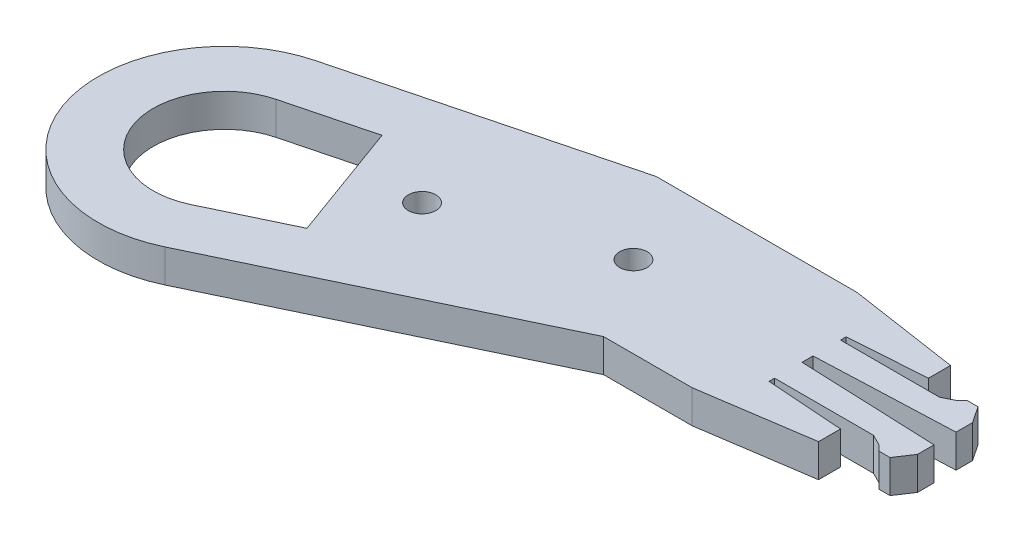
ISO-10303-21;
HEADER;
FILE_DESCRIPTION(('STEP AP214'),'2;1');
FILE_NAME('part.step','',(''),(''),'','','');
FILE_SCHEMA(('AUTOMOTIVE_DESIGN { 1 0 10303 214 1 1 1 1 }'));
ENDSEC;
DATA;
#1=APPLICATION_CONTEXT('core data for automotive mechanical design processes');
#2=APPLICATION_PROTOCOL_DEFINITION('international standard','automotive_design',2000,#1);
#3=PRODUCT_CONTEXT('',#1,'mechanical');
#4=PRODUCT('Part','Part','',(#3));
#5=PRODUCT_RELATED_PRODUCT_CATEGORY('part','',(#4));
#6=PRODUCT_DEFINITION_FORMATION('','',#4);
#7=PRODUCT_DEFINITION_CONTEXT('part definition',#1,'design');
#8=PRODUCT_DEFINITION('design','',#6,#7);
#9=PRODUCT_DEFINITION_SHAPE('','',#8);
#10=(LENGTH_UNIT() NAMED_UNIT(*) SI_UNIT(.MILLI.,.METRE.));
#11=(NAMED_UNIT(*) PLANE_ANGLE_UNIT() SI_UNIT($,.RADIAN.));
#12=(NAMED_UNIT(*) SI_UNIT($,.STERADIAN.) SOLID_ANGLE_UNIT());
#13=UNCERTAINTY_MEASURE_WITH_UNIT(LENGTH_MEASURE(1.E-05),#10,'distance_accuracy_value','');
#14=(GEOMETRIC_REPRESENTATION_CONTEXT(3) GLOBAL_UNCERTAINTY_ASSIGNED_CONTEXT((#13)) GLOBAL_UNIT_ASSIGNED_CONTEXT((#10,
#11,#12)) REPRESENTATION_CONTEXT('',''));
#15=CARTESIAN_POINT('',(0.,0.,0.));
#16=DIRECTION('',(0.,0.,1.));
#17=DIRECTION('',(1.,0.,0.));
#18=AXIS2_PLACEMENT_3D('',#15,#16,#17);
#19=CARTESIAN_POINT('',(-2.87937004662604,-3.,-11.1336978643482));
#20=DIRECTION('',(0.250380004054438,0.,0.968147640378109));
#21=DIRECTION('',(0.968147640378109,0.,-0.250380004054438));
#22=AXIS2_PLACEMENT_3D('',#19,#20,#21);
#23=PLANE('',#22);
#24=DIRECTION('',(0.968147640378109,0.,-0.250380004054438));
#25=VECTOR('',#24,1.);
#26=CARTESIAN_POINT('',(-2.87937004662604,0.,-11.1336978643482));
#27=LINE('',#26,#25);
#28=CARTESIAN_POINT('',(-2.87937004662604,0.,-11.1336978643482));
#29=VERTEX_POINT('',#28);
#30=CARTESIAN_POINT('',(21.7372937873807,0.,-17.5));
#31=VERTEX_POINT('',#30);
#32=EDGE_CURVE('E296',#29,#31,#27,.T.);
#33=ORIENTED_EDGE('',*,*,#32,.T.);
#34=DIRECTION('',(0.,1.,0.));
#35=VECTOR('',#34,1.);
#36=CARTESIAN_POINT('',(21.7372937873807,-3.,-17.5));
#37=LINE('',#36,#35);
#38=CARTESIAN_POINT('',(21.7372937873807,-3.,-17.5));
#39=VERTEX_POINT('',#38);
#40=EDGE_CURVE('E11',#39,#31,#37,.T.);
#41=ORIENTED_EDGE('',*,*,#40,.F.);
#42=DIRECTION('',(0.968147640378109,0.,-0.250380004054438));
#43=VECTOR('',#42,1.);
#44=CARTESIAN_POINT('',(-2.87937004662604,-3.,-11.1336978643482));
#45=LINE('',#44,#43);
#46=CARTESIAN_POINT('',(-2.87937004662604,-3.,-11.1336978643482));
#47=VERTEX_POINT('',#46);
#48=EDGE_CURVE('E53',#47,#39,#45,.T.);
#49=ORIENTED_EDGE('',*,*,#48,.F.);
#50=DIRECTION('',(0.,1.,0.));
#51=VECTOR('',#50,1.);
#52=CARTESIAN_POINT('',(-2.87937004662604,-3.,-11.1336978643482));
#53=LINE('',#52,#51);
#54=EDGE_CURVE('E431',#47,#29,#53,.T.);
#55=ORIENTED_EDGE('',*,*,#54,.T.);
#56=EDGE_LOOP('',(#33,#41,#49,#55));
#57=FACE_BOUND('',#56,.T.);
#58=ADVANCED_FACE('F34',(#57),#23,.F.);
#59=CARTESIAN_POINT('',(0.,-3.,-17.5));
#60=DIRECTION('',(0.,0.,-1.));
#61=DIRECTION('',(-1.,0.,0.));
#62=AXIS2_PLACEMENT_3D('',#59,#60,#61);
#63=PLANE('',#62);
#64=DIRECTION('',(-1.,0.,0.));
#65=VECTOR('',#64,1.);
#66=CARTESIAN_POINT('',(0.,0.,-17.5));
#67=LINE('',#66,#65);
#68=CARTESIAN_POINT('',(40.,0.,-17.5));
#69=VERTEX_POINT('',#68);
#70=EDGE_CURVE('E361',#69,#31,#67,.T.);
#71=ORIENTED_EDGE('',*,*,#70,.F.);
#72=DIRECTION('',(0.,1.,0.));
#73=VECTOR('',#72,1.);
#74=CARTESIAN_POINT('',(40.,-3.,-17.5));
#75=LINE('',#74,#73);
#76=CARTESIAN_POINT('',(40.,-3.,-17.5));
#77=VERTEX_POINT('',#76);
#78=EDGE_CURVE('E44',#77,#69,#75,.T.);
#79=ORIENTED_EDGE('',*,*,#78,.F.);
#80=DIRECTION('',(-1.,0.,0.));
#81=VECTOR('',#80,1.);
#82=CARTESIAN_POINT('',(0.,-3.,-17.5));
#83=LINE('',#82,#81);
#84=EDGE_CURVE('E269',#77,#39,#83,.T.);
#85=ORIENTED_EDGE('',*,*,#84,.T.);
#86=ORIENTED_EDGE('',*,*,#40,.T.);
#87=EDGE_LOOP('',(#71,#79,#85,#86));
#88=FACE_BOUND('',#87,.T.);
#89=ADVANCED_FACE('F620',(#88),#63,.T.);
#90=CARTESIAN_POINT('',(3.44743276283618,-3.,-22.9828850855746));
#91=DIRECTION('',(0.148340452930244,0.,-0.988936352868298));
#92=DIRECTION('',(-0.988936352868298,0.,-0.148340452930244));
#93=AXIS2_PLACEMENT_3D('',#90,#91,#92);
#94=PLANE('',#93);
#95=DIRECTION('',(-0.988936352868298,0.,-0.148340452930244));
#96=VECTOR('',#95,1.);
#97=CARTESIAN_POINT('',(3.44743276283618,0.,-22.9828850855746));
#98=LINE('',#97,#96);
#99=CARTESIAN_POINT('',(50.,0.,-16.));
#100=VERTEX_POINT('',#99);
#101=EDGE_CURVE('E256',#100,#69,#98,.T.);
#102=ORIENTED_EDGE('',*,*,#101,.F.);
#103=DIRECTION('',(0.,1.,0.));
#104=VECTOR('',#103,1.);
#105=CARTESIAN_POINT('',(50.,-3.,-16.));
#106=LINE('',#105,#104);
#107=CARTESIAN_POINT('',(50.,-3.,-16.));
#108=VERTEX_POINT('',#107);
#109=EDGE_CURVE('E252',#108,#100,#106,.T.);
#110=ORIENTED_EDGE('',*,*,#109,.F.);
#111=DIRECTION('',(-0.988936352868298,0.,-0.148340452930244));
#112=VECTOR('',#111,1.);
#113=CARTESIAN_POINT('',(3.44743276283618,-3.,-22.9828850855746));
#114=LINE('',#113,#112);
#115=EDGE_CURVE('E255',#108,#77,#114,.T.);
#116=ORIENTED_EDGE('',*,*,#115,.T.);
#117=ORIENTED_EDGE('',*,*,#78,.T.);
#118=EDGE_LOOP('',(#102,#110,#116,#117));
#119=FACE_BOUND('',#118,.T.);
#120=ADVANCED_FACE('F254',(#119),#94,.T.);
#121=CARTESIAN_POINT('',(50.,-3.,0.));
#122=DIRECTION('',(1.,0.,0.));
#123=DIRECTION('',(0.,0.,-1.));
#124=AXIS2_PLACEMENT_3D('',#121,#122,#123);
#125=PLANE('',#124);
#126=DIRECTION('',(0.,0.,-1.));
#127=VECTOR('',#126,1.);
#128=CARTESIAN_POINT('',(50.,0.,0.));
#129=LINE('',#128,#127);
#130=CARTESIAN_POINT('',(50.,0.,-14.));
#131=VERTEX_POINT('',#130);
#132=EDGE_CURVE('E358',#131,#100,#129,.T.);
#133=ORIENTED_EDGE('',*,*,#132,.F.);
#134=DIRECTION('',(0.,1.,0.));
#135=VECTOR('',#134,1.);
#136=CARTESIAN_POINT('',(50.,-3.,-14.));
#137=LINE('',#136,#135);
#138=CARTESIAN_POINT('',(50.,-3.,-14.));
#139=VERTEX_POINT('',#138);
#140=EDGE_CURVE('E261',#139,#131,#137,.T.);
#141=ORIENTED_EDGE('',*,*,#140,.F.);
#142=DIRECTION('',(0.,0.,-1.));
#143=VECTOR('',#142,1.);
#144=CARTESIAN_POINT('',(50.,-3.,0.));
#145=LINE('',#144,#143);
#146=EDGE_CURVE('E267',#139,#108,#145,.T.);
#147=ORIENTED_EDGE('',*,*,#146,.T.);
#148=ORIENTED_EDGE('',*,*,#109,.T.);
#149=EDGE_LOOP('',(#133,#141,#147,#148));
#150=FACE_BOUND('',#149,.T.);
#151=ADVANCED_FACE('F271',(#150),#125,.T.);
#152=CARTESIAN_POINT('',(-0.741116751269036,-3.,-10.3756345177665));
#153=DIRECTION('',(0.0712470499879097,0.,0.997458699830735));
#154=DIRECTION('',(0.997458699830735,0.,-0.0712470499879097));
#155=AXIS2_PLACEMENT_3D('',#152,#153,#154);
#156=PLANE('',#155);
#157=DIRECTION('',(0.997458699830735,0.,-0.0712470499879097));
#158=VECTOR('',#157,1.);
#159=CARTESIAN_POINT('',(-0.741116751269036,0.,-10.3756345177665));
#160=LINE('',#159,#158);
#161=CARTESIAN_POINT('',(43.,0.,-13.5));
#162=VERTEX_POINT('',#161);
#163=EDGE_CURVE('E355',#162,#131,#160,.T.);
#164=ORIENTED_EDGE('',*,*,#163,.F.);
#165=DIRECTION('',(0.,1.,0.));
#166=VECTOR('',#165,1.);
#167=CARTESIAN_POINT('',(43.,-3.,-13.5));
#168=LINE('',#167,#166);
#169=CARTESIAN_POINT('',(43.,-3.,-13.5));
#170=VERTEX_POINT('',#169);
#171=EDGE_CURVE('E373',#170,#162,#168,.T.);
#172=ORIENTED_EDGE('',*,*,#171,.F.);
#173=DIRECTION('',(0.997458699830735,0.,-0.0712470499879097));
#174=VECTOR('',#173,1.);
#175=CARTESIAN_POINT('',(-0.741116751269036,-3.,-10.3756345177665));
#176=LINE('',#175,#174);
#177=EDGE_CURVE('E272',#170,#139,#176,.T.);
#178=ORIENTED_EDGE('',*,*,#177,.T.);
#179=ORIENTED_EDGE('',*,*,#140,.T.);
#180=EDGE_LOOP('',(#164,#172,#178,#179));
#181=FACE_BOUND('',#180,.T.);
#182=ADVANCED_FACE('F623',(#181),#156,.T.);
#183=CARTESIAN_POINT('',(42.9999999999998,-3.,5.96744875736021E-13));
#184=DIRECTION('',(1.,0.,0.));
#185=DIRECTION('',(0.,0.,-1.));
#186=AXIS2_PLACEMENT_3D('',#183,#184,#185);
#187=PLANE('',#186);
#188=DIRECTION('',(0.,0.,-1.));
#189=VECTOR('',#188,1.);
#190=CARTESIAN_POINT('',(42.9999999999998,0.,5.96744875736021E-13));
#191=LINE('',#190,#189);
#192=CARTESIAN_POINT('',(43.,0.,-13.));
#193=VERTEX_POINT('',#192);
#194=EDGE_CURVE('E352',#193,#162,#191,.T.);
#195=ORIENTED_EDGE('',*,*,#194,.F.);
#196=DIRECTION('',(0.,1.,0.));
#197=VECTOR('',#196,1.);
#198=CARTESIAN_POINT('',(43.,-3.,-13.));
#199=LINE('',#198,#197);
#200=CARTESIAN_POINT('',(43.,-3.,-13.));
#201=VERTEX_POINT('',#200);
#202=EDGE_CURVE('E375',#201,#193,#199,.T.);
#203=ORIENTED_EDGE('',*,*,#202,.F.);
#204=DIRECTION('',(0.,0.,-1.));
#205=VECTOR('',#204,1.);
#206=CARTESIAN_POINT('',(42.9999999999998,-3.,5.96744875736021E-13));
#207=LINE('',#206,#205);
#208=EDGE_CURVE('E274',#201,#170,#207,.T.);
#209=ORIENTED_EDGE('',*,*,#208,.T.);
#210=ORIENTED_EDGE('',*,*,#171,.T.);
#211=EDGE_LOOP('',(#195,#203,#209,#210));
#212=FACE_BOUND('',#211,.T.);
#213=ADVANCED_FACE('F517',(#212),#187,.T.);
#214=CARTESIAN_POINT('',(0.,-3.,-13.));
#215=DIRECTION('',(0.,0.,-1.));
#216=DIRECTION('',(-1.,0.,0.));
#217=AXIS2_PLACEMENT_3D('',#214,#215,#216);
#218=PLANE('',#217);
#219=DIRECTION('',(-1.,0.,0.));
#220=VECTOR('',#219,1.);
#221=CARTESIAN_POINT('',(0.,0.,-13.));
#222=LINE('',#221,#220);
#223=CARTESIAN_POINT('',(52.,0.,-13.));
#224=VERTEX_POINT('',#223);
#225=EDGE_CURVE('E349',#224,#193,#222,.T.);
#226=ORIENTED_EDGE('',*,*,#225,.F.);
#227=DIRECTION('',(0.,1.,0.));
#228=VECTOR('',#227,1.);
#229=CARTESIAN_POINT('',(52.,-3.,-13.));
#230=LINE('',#229,#228);
#231=CARTESIAN_POINT('',(52.,-3.,-13.));
#232=VERTEX_POINT('',#231);
#233=EDGE_CURVE('E377',#232,#224,#230,.T.);
#234=ORIENTED_EDGE('',*,*,#233,.F.);
#235=DIRECTION('',(-1.,0.,0.));
#236=VECTOR('',#235,1.);
#237=CARTESIAN_POINT('',(0.,-3.,-13.));
#238=LINE('',#237,#236);
#239=EDGE_CURVE('E511',#232,#201,#238,.T.);
#240=ORIENTED_EDGE('',*,*,#239,.T.);
#241=ORIENTED_EDGE('',*,*,#202,.T.);
#242=EDGE_LOOP('',(#226,#234,#240,#241));
#243=FACE_BOUND('',#242,.T.);
#244=ADVANCED_FACE('F523',(#243),#218,.T.);
#245=CARTESIAN_POINT('',(5.19999999999995,-3.,10.3999999999999));
#246=DIRECTION('',(-0.447213595499957,0.,-0.894427190999917));
#247=DIRECTION('',(-0.894427190999917,0.,0.447213595499957));
#248=AXIS2_PLACEMENT_3D('',#245,#246,#247);
#249=PLANE('',#248);
#250=DIRECTION('',(-0.894427190999917,0.,0.447213595499957));
#251=VECTOR('',#250,1.);
#252=CARTESIAN_POINT('',(5.19999999999995,0.,10.3999999999999));
#253=LINE('',#252,#251);
#254=CARTESIAN_POINT('',(53.,0.,-13.5));
#255=VERTEX_POINT('',#254);
#256=EDGE_CURVE('E346',#255,#224,#253,.T.);
#257=ORIENTED_EDGE('',*,*,#256,.F.);
#258=DIRECTION('',(0.,1.,0.));
#259=VECTOR('',#258,1.);
#260=CARTESIAN_POINT('',(53.,-3.,-13.5));
#261=LINE('',#260,#259);
#262=CARTESIAN_POINT('',(53.,-3.,-13.5));
#263=VERTEX_POINT('',#262);
#264=EDGE_CURVE('E379',#263,#255,#261,.T.);
#265=ORIENTED_EDGE('',*,*,#264,.F.);
#266=DIRECTION('',(-0.894427190999917,0.,0.447213595499957));
#267=VECTOR('',#266,1.);
#268=CARTESIAN_POINT('',(5.19999999999995,-3.,10.3999999999999));
#269=LINE('',#268,#267);
#270=EDGE_CURVE('E508',#263,#232,#269,.T.);
#271=ORIENTED_EDGE('',*,*,#270,.T.);
#272=ORIENTED_EDGE('',*,*,#233,.T.);
#273=EDGE_LOOP('',(#257,#265,#271,#272));
#274=FACE_BOUND('',#273,.T.);
#275=ADVANCED_FACE('F526',(#274),#249,.T.);
#276=CARTESIAN_POINT('',(19.75,-3.,19.75));
#277=DIRECTION('',(-0.707106781186547,0.,-0.707106781186547));
#278=DIRECTION('',(-0.707106781186548,0.,0.707106781186548));
#279=AXIS2_PLACEMENT_3D('',#276,#277,#278);
#280=PLANE('',#279);
#281=DIRECTION('',(-0.707106781186548,0.,0.707106781186548));
#282=VECTOR('',#281,1.);
#283=CARTESIAN_POINT('',(19.75,0.,19.75));
#284=LINE('',#283,#282);
#285=CARTESIAN_POINT('',(53.5,0.,-14.));
#286=VERTEX_POINT('',#285);
#287=EDGE_CURVE('E343',#286,#255,#284,.T.);
#288=ORIENTED_EDGE('',*,*,#287,.F.);
#289=DIRECTION('',(0.,1.,0.));
#290=VECTOR('',#289,1.);
#291=CARTESIAN_POINT('',(53.5,-3.,-14.));
#292=LINE('',#291,#290);
#293=CARTESIAN_POINT('',(53.5,-3.,-14.));
#294=VERTEX_POINT('',#293);
#295=EDGE_CURVE('E381',#294,#286,#292,.T.);
#296=ORIENTED_EDGE('',*,*,#295,.F.);
#297=DIRECTION('',(-0.707106781186548,0.,0.707106781186548));
#298=VECTOR('',#297,1.);
#299=CARTESIAN_POINT('',(19.75,-3.,19.75));
#300=LINE('',#299,#298);
#301=EDGE_CURVE('E505',#294,#263,#300,.T.);
#302=ORIENTED_EDGE('',*,*,#301,.T.);
#303=ORIENTED_EDGE('',*,*,#264,.T.);
#304=EDGE_LOOP('',(#288,#296,#302,#303));
#305=FACE_BOUND('',#304,.T.);
#306=ADVANCED_FACE('F531',(#305),#280,.T.);
#307=CARTESIAN_POINT('',(0.,-3.,-13.9999999999999));
#308=DIRECTION('',(0.,0.,-1.));
#309=DIRECTION('',(-1.,0.,0.));
#310=AXIS2_PLACEMENT_3D('',#307,#308,#309);
#311=PLANE('',#310);
#312=DIRECTION('',(-1.,0.,0.));
#313=VECTOR('',#312,1.);
#314=CARTESIAN_POINT('',(0.,0.,-13.9999999999999));
#315=LINE('',#314,#313);
#316=CARTESIAN_POINT('',(54.5,0.,-14.));
#317=VERTEX_POINT('',#316);
#318=EDGE_CURVE('E340',#317,#286,#315,.T.);
#319=ORIENTED_EDGE('',*,*,#318,.F.);
#320=DIRECTION('',(0.,1.,0.));
#321=VECTOR('',#320,1.);
#322=CARTESIAN_POINT('',(54.5,-3.,-14.));
#323=LINE('',#322,#321);
#324=CARTESIAN_POINT('',(54.5,-3.,-14.));
#325=VERTEX_POINT('',#324);
#326=EDGE_CURVE('E383',#325,#317,#323,.T.);
#327=ORIENTED_EDGE('',*,*,#326,.F.);
#328=DIRECTION('',(-1.,0.,0.));
#329=VECTOR('',#328,1.);
#330=CARTESIAN_POINT('',(0.,-3.,-13.9999999999999));
#331=LINE('',#330,#329);
#332=EDGE_CURVE('E502',#325,#294,#331,.T.);
#333=ORIENTED_EDGE('',*,*,#332,.T.);
#334=ORIENTED_EDGE('',*,*,#295,.T.);
#335=EDGE_LOOP('',(#319,#327,#333,#334));
#336=FACE_BOUND('',#335,.T.);
#337=ADVANCED_FACE('F534',(#336),#311,.T.);
#338=CARTESIAN_POINT('',(44.1923076923077,-3.,-29.4615384615385));
#339=DIRECTION('',(0.832050294337843,0.,-0.554700196225229));
#340=DIRECTION('',(-0.554700196225229,0.,-0.832050294337844));
#341=AXIS2_PLACEMENT_3D('',#338,#339,#340);
#342=PLANE('',#341);
#343=DIRECTION('',(-0.554700196225229,0.,-0.832050294337844));
#344=VECTOR('',#343,1.);
#345=CARTESIAN_POINT('',(44.1923076923077,0.,-29.4615384615385));
#346=LINE('',#345,#344);
#347=CARTESIAN_POINT('',(55.5,0.,-12.5));
#348=VERTEX_POINT('',#347);
#349=EDGE_CURVE('E337',#348,#317,#346,.T.);
#350=ORIENTED_EDGE('',*,*,#349,.F.);
#351=DIRECTION('',(0.,1.,0.));
#352=VECTOR('',#351,1.);
#353=CARTESIAN_POINT('',(55.5,-3.,-12.5));
#354=LINE('',#353,#352);
#355=CARTESIAN_POINT('',(55.5,-3.,-12.5));
#356=VERTEX_POINT('',#355);
#357=EDGE_CURVE('E385',#356,#348,#354,.T.);
#358=ORIENTED_EDGE('',*,*,#357,.F.);
#359=DIRECTION('',(-0.554700196225229,0.,-0.832050294337844));
#360=VECTOR('',#359,1.);
#361=CARTESIAN_POINT('',(44.1923076923077,-3.,-29.4615384615385));
#362=LINE('',#361,#360);
#363=EDGE_CURVE('E499',#356,#325,#362,.T.);
#364=ORIENTED_EDGE('',*,*,#363,.T.);
#365=ORIENTED_EDGE('',*,*,#326,.T.);
#366=EDGE_LOOP('',(#350,#358,#364,#365));
#367=FACE_BOUND('',#366,.T.);
#368=ADVANCED_FACE('F539',(#367),#342,.T.);
#369=CARTESIAN_POINT('',(55.5,-3.,0.));
#370=DIRECTION('',(1.,0.,0.));
#371=DIRECTION('',(0.,0.,-1.));
#372=AXIS2_PLACEMENT_3D('',#369,#370,#371);
#373=PLANE('',#372);
#374=DIRECTION('',(0.,0.,-1.));
#375=VECTOR('',#374,1.);
#376=CARTESIAN_POINT('',(55.5,0.,0.));
#377=LINE('',#376,#375);
#378=CARTESIAN_POINT('',(55.5,0.,-11.));
#379=VERTEX_POINT('',#378);
#380=EDGE_CURVE('E334',#379,#348,#377,.T.);
#381=ORIENTED_EDGE('',*,*,#380,.F.);
#382=DIRECTION('',(0.,1.,0.));
#383=VECTOR('',#382,1.);
#384=CARTESIAN_POINT('',(55.5,-3.,-11.));
#385=LINE('',#384,#383);
#386=CARTESIAN_POINT('',(55.5,-3.,-11.));
#387=VERTEX_POINT('',#386);
#388=EDGE_CURVE('E387',#387,#379,#385,.T.);
#389=ORIENTED_EDGE('',*,*,#388,.F.);
#390=DIRECTION('',(0.,0.,-1.));
#391=VECTOR('',#390,1.);
#392=CARTESIAN_POINT('',(55.5,-3.,0.));
#393=LINE('',#392,#391);
#394=EDGE_CURVE('E496',#387,#356,#393,.T.);
#395=ORIENTED_EDGE('',*,*,#394,.T.);
#396=ORIENTED_EDGE('',*,*,#357,.T.);
#397=EDGE_LOOP('',(#381,#389,#395,#396));
#398=FACE_BOUND('',#397,.T.);
#399=ADVANCED_FACE('F542',(#398),#373,.T.);
#400=CARTESIAN_POINT('',(-0.350638977635782,-3.,-8.76597444089457));
#401=DIRECTION('',(0.0399680383488715,0.,0.999200958721789));
#402=DIRECTION('',(0.99920095872179,0.,-0.0399680383488715));
#403=AXIS2_PLACEMENT_3D('',#400,#401,#402);
#404=PLANE('',#403);
#405=DIRECTION('',(0.99920095872179,0.,-0.0399680383488715));
#406=VECTOR('',#405,1.);
#407=CARTESIAN_POINT('',(-0.350638977635782,0.,-8.76597444089457));
#408=LINE('',#407,#406);
#409=CARTESIAN_POINT('',(43.,0.,-10.5));
#410=VERTEX_POINT('',#409);
#411=EDGE_CURVE('E331',#410,#379,#408,.T.);
#412=ORIENTED_EDGE('',*,*,#411,.F.);
#413=DIRECTION('',(0.,1.,0.));
#414=VECTOR('',#413,1.);
#415=CARTESIAN_POINT('',(43.,-3.,-10.5));
#416=LINE('',#415,#414);
#417=CARTESIAN_POINT('',(43.,-3.,-10.5));
#418=VERTEX_POINT('',#417);
#419=EDGE_CURVE('E389',#418,#410,#416,.T.);
#420=ORIENTED_EDGE('',*,*,#419,.F.);
#421=DIRECTION('',(0.99920095872179,0.,-0.0399680383488715));
#422=VECTOR('',#421,1.);
#423=CARTESIAN_POINT('',(-0.350638977635782,-3.,-8.76597444089457));
#424=LINE('',#423,#422);
#425=EDGE_CURVE('E493',#418,#387,#424,.T.);
#426=ORIENTED_EDGE('',*,*,#425,.T.);
#427=ORIENTED_EDGE('',*,*,#388,.T.);
#428=EDGE_LOOP('',(#412,#420,#426,#427));
#429=FACE_BOUND('',#428,.T.);
#430=ADVANCED_FACE('F546',(#429),#404,.T.);
#431=CARTESIAN_POINT('',(43.,-3.,0.));
#432=DIRECTION('',(-1.,0.,0.));
#433=DIRECTION('',(0.,0.,1.));
#434=AXIS2_PLACEMENT_3D('',#431,#432,#433);
#435=PLANE('',#434);
#436=DIRECTION('',(0.,0.,1.));
#437=VECTOR('',#436,1.);
#438=CARTESIAN_POINT('',(43.,0.,0.));
#439=LINE('',#438,#437);
#440=CARTESIAN_POINT('',(43.,0.,-9.5));
#441=VERTEX_POINT('',#440);
#442=EDGE_CURVE('E329',#410,#441,#439,.T.);
#443=ORIENTED_EDGE('',*,*,#442,.T.);
#444=DIRECTION('',(0.,1.,0.));
#445=VECTOR('',#444,1.);
#446=CARTESIAN_POINT('',(43.,-3.,-9.5));
#447=LINE('',#446,#445);
#448=CARTESIAN_POINT('',(43.,-3.,-9.5));
#449=VERTEX_POINT('',#448);
#450=EDGE_CURVE('E391',#449,#441,#447,.T.);
#451=ORIENTED_EDGE('',*,*,#450,.F.);
#452=DIRECTION('',(0.,0.,1.));
#453=VECTOR('',#452,1.);
#454=CARTESIAN_POINT('',(43.,-3.,0.));
#455=LINE('',#454,#453);
#456=EDGE_CURVE('E491',#418,#449,#455,.T.);
#457=ORIENTED_EDGE('',*,*,#456,.F.);
#458=ORIENTED_EDGE('',*,*,#419,.T.);
#459=EDGE_LOOP('',(#443,#451,#457,#458));
#460=FACE_BOUND('',#459,.T.);
#461=ADVANCED_FACE('F551',(#460),#435,.F.);
#462=CARTESIAN_POINT('',(0.448083067092651,-3.,-11.2020766773163));
#463=DIRECTION('',(-0.0399680383488715,0.,0.999200958721789));
#464=DIRECTION('',(0.99920095872179,0.,0.0399680383488715));
#465=AXIS2_PLACEMENT_3D('',#462,#463,#464);
#466=PLANE('',#465);
#467=DIRECTION('',(0.99920095872179,0.,0.0399680383488715));
#468=VECTOR('',#467,1.);
#469=CARTESIAN_POINT('',(0.448083067092651,0.,-11.2020766773163));
#470=LINE('',#469,#468);
#471=CARTESIAN_POINT('',(55.5,0.,-9.));
#472=VERTEX_POINT('',#471);
#473=EDGE_CURVE('E327',#441,#472,#470,.T.);
#474=ORIENTED_EDGE('',*,*,#473,.T.);
#475=DIRECTION('',(0.,1.,0.));
#476=VECTOR('',#475,1.);
#477=CARTESIAN_POINT('',(55.5,-3.,-9.));
#478=LINE('',#477,#476);
#479=CARTESIAN_POINT('',(55.5,-3.,-9.));
#480=VERTEX_POINT('',#479);
#481=EDGE_CURVE('E394',#480,#472,#478,.T.);
#482=ORIENTED_EDGE('',*,*,#481,.F.);
#483=DIRECTION('',(0.99920095872179,0.,0.0399680383488715));
#484=VECTOR('',#483,1.);
#485=CARTESIAN_POINT('',(0.448083067092651,-3.,-11.2020766773163));
#486=LINE('',#485,#484);
#487=EDGE_CURVE('E489',#449,#480,#486,.T.);
#488=ORIENTED_EDGE('',*,*,#487,.F.);
#489=ORIENTED_EDGE('',*,*,#450,.T.);
#490=EDGE_LOOP('',(#474,#482,#488,#489));
#491=FACE_BOUND('',#490,.T.);
#492=ADVANCED_FACE('F557',(#491),#466,.F.);
#493=CARTESIAN_POINT('',(55.5,-3.,0.));
#494=DIRECTION('',(-1.,0.,0.));
#495=DIRECTION('',(0.,0.,1.));
#496=AXIS2_PLACEMENT_3D('',#493,#494,#495);
#497=PLANE('',#496);
#498=DIRECTION('',(0.,0.,1.));
#499=VECTOR('',#498,1.);
#500=CARTESIAN_POINT('',(55.5,0.,0.));
#501=LINE('',#500,#499);
#502=CARTESIAN_POINT('',(55.5,0.,-7.5));
#503=VERTEX_POINT('',#502);
#504=EDGE_CURVE('E325',#472,#503,#501,.T.);
#505=ORIENTED_EDGE('',*,*,#504,.T.);
#506=DIRECTION('',(0.,1.,0.));
#507=VECTOR('',#506,1.);
#508=CARTESIAN_POINT('',(55.5,-3.,-7.5));
#509=LINE('',#508,#507);
#510=CARTESIAN_POINT('',(55.5,-3.,-7.5));
#511=VERTEX_POINT('',#510);
#512=EDGE_CURVE('E397',#511,#503,#509,.T.);
#513=ORIENTED_EDGE('',*,*,#512,.F.);
#514=DIRECTION('',(0.,0.,1.));
#515=VECTOR('',#514,1.);
#516=CARTESIAN_POINT('',(55.5,-3.,0.));
#517=LINE('',#516,#515);
#518=EDGE_CURVE('E487',#480,#511,#517,.T.);
#519=ORIENTED_EDGE('',*,*,#518,.F.);
#520=ORIENTED_EDGE('',*,*,#481,.T.);
#521=EDGE_LOOP('',(#505,#513,#519,#520));
#522=FACE_BOUND('',#521,.T.);
#523=ADVANCED_FACE('F561',(#522),#497,.F.);
#524=CARTESIAN_POINT('',(34.9615384615384,-3.,23.3076923076923));
#525=DIRECTION('',(-0.832050294337843,0.,-0.554700196225229));
#526=DIRECTION('',(-0.554700196225229,0.,0.832050294337844));
#527=AXIS2_PLACEMENT_3D('',#524,#525,#526);
#528=PLANE('',#527);
#529=DIRECTION('',(-0.554700196225229,0.,0.832050294337844));
#530=VECTOR('',#529,1.);
#531=CARTESIAN_POINT('',(34.9615384615384,0.,23.3076923076923));
#532=LINE('',#531,#530);
#533=CARTESIAN_POINT('',(54.5,0.,-6.));
#534=VERTEX_POINT('',#533);
#535=EDGE_CURVE('E323',#503,#534,#532,.T.);
#536=ORIENTED_EDGE('',*,*,#535,.T.);
#537=DIRECTION('',(0.,1.,0.));
#538=VECTOR('',#537,1.);
#539=CARTESIAN_POINT('',(54.5,-3.,-6.));
#540=LINE('',#539,#538);
#541=CARTESIAN_POINT('',(54.5,-3.,-6.));
#542=VERTEX_POINT('',#541);
#543=EDGE_CURVE('E400',#542,#534,#540,.T.);
#544=ORIENTED_EDGE('',*,*,#543,.F.);
#545=DIRECTION('',(-0.554700196225229,0.,0.832050294337844));
#546=VECTOR('',#545,1.);
#547=CARTESIAN_POINT('',(34.9615384615384,-3.,23.3076923076923));
#548=LINE('',#547,#546);
#549=EDGE_CURVE('E485',#511,#542,#548,.T.);
#550=ORIENTED_EDGE('',*,*,#549,.F.);
#551=ORIENTED_EDGE('',*,*,#512,.T.);
#552=EDGE_LOOP('',(#536,#544,#550,#551));
#553=FACE_BOUND('',#552,.T.);
#554=ADVANCED_FACE('F566',(#553),#528,.F.);
#555=CARTESIAN_POINT('',(0.,-3.,-6.00000000000005));
#556=DIRECTION('',(0.,0.,-1.));
#557=DIRECTION('',(-1.,0.,0.));
#558=AXIS2_PLACEMENT_3D('',#555,#556,#557);
#559=PLANE('',#558);
#560=DIRECTION('',(-1.,0.,0.));
#561=VECTOR('',#560,1.);
#562=CARTESIAN_POINT('',(0.,0.,-6.00000000000005));
#563=LINE('',#562,#561);
#564=CARTESIAN_POINT('',(53.5,0.,-6.));
#565=VERTEX_POINT('',#564);
#566=EDGE_CURVE('E321',#534,#565,#563,.T.);
#567=ORIENTED_EDGE('',*,*,#566,.T.);
#568=DIRECTION('',(0.,1.,0.));
#569=VECTOR('',#568,1.);
#570=CARTESIAN_POINT('',(53.5,-3.,-6.));
#571=LINE('',#570,#569);
#572=CARTESIAN_POINT('',(53.5,-3.,-6.));
#573=VERTEX_POINT('',#572);
#574=EDGE_CURVE('E403',#573,#565,#571,.T.);
#575=ORIENTED_EDGE('',*,*,#574,.F.);
#576=DIRECTION('',(-1.,0.,0.));
#577=VECTOR('',#576,1.);
#578=CARTESIAN_POINT('',(0.,-3.,-6.00000000000005));
#579=LINE('',#578,#577);
#580=EDGE_CURVE('E483',#542,#573,#579,.T.);
#581=ORIENTED_EDGE('',*,*,#580,.F.);
#582=ORIENTED_EDGE('',*,*,#543,.T.);
#583=EDGE_LOOP('',(#567,#575,#581,#582));
#584=FACE_BOUND('',#583,.T.);
#585=ADVANCED_FACE('F572',(#584),#559,.F.);
#586=CARTESIAN_POINT('',(29.75,-3.,-29.75));
#587=DIRECTION('',(0.707106781186547,0.,-0.707106781186547));
#588=DIRECTION('',(-0.707106781186548,0.,-0.707106781186548));
#589=AXIS2_PLACEMENT_3D('',#586,#587,#588);
#590=PLANE('',#589);
#591=DIRECTION('',(-0.707106781186548,0.,-0.707106781186548));
#592=VECTOR('',#591,1.);
#593=CARTESIAN_POINT('',(29.75,0.,-29.75));
#594=LINE('',#593,#592);
#595=CARTESIAN_POINT('',(53.,0.,-6.5));
#596=VERTEX_POINT('',#595);
#597=EDGE_CURVE('E319',#565,#596,#594,.T.);
#598=ORIENTED_EDGE('',*,*,#597,.T.);
#599=DIRECTION('',(0.,1.,0.));
#600=VECTOR('',#599,1.);
#601=CARTESIAN_POINT('',(53.,-3.,-6.5));
#602=LINE('',#601,#600);
#603=CARTESIAN_POINT('',(53.,-3.,-6.5));
#604=VERTEX_POINT('',#603);
#605=EDGE_CURVE('E406',#604,#596,#602,.T.);
#606=ORIENTED_EDGE('',*,*,#605,.F.);
#607=DIRECTION('',(-0.707106781186548,0.,-0.707106781186548));
#608=VECTOR('',#607,1.);
#609=CARTESIAN_POINT('',(29.75,-3.,-29.75));
#610=LINE('',#609,#608);
#611=EDGE_CURVE('E481',#573,#604,#610,.T.);
#612=ORIENTED_EDGE('',*,*,#611,.F.);
#613=ORIENTED_EDGE('',*,*,#574,.T.);
#614=EDGE_LOOP('',(#598,#606,#612,#613));
#615=FACE_BOUND('',#614,.T.);
#616=ADVANCED_FACE('F576',(#615),#590,.F.);
#617=CARTESIAN_POINT('',(13.2,-3.,-26.4));
#618=DIRECTION('',(0.447213595499957,0.,-0.894427190999916));
#619=DIRECTION('',(-0.894427190999916,0.,-0.447213595499957));
#620=AXIS2_PLACEMENT_3D('',#617,#618,#619);
#621=PLANE('',#620);
#622=DIRECTION('',(-0.894427190999916,0.,-0.447213595499957));
#623=VECTOR('',#622,1.);
#624=CARTESIAN_POINT('',(13.2,0.,-26.4));
#625=LINE('',#624,#623);
#626=CARTESIAN_POINT('',(52.,0.,-7.));
#627=VERTEX_POINT('',#626);
#628=EDGE_CURVE('E317',#596,#627,#625,.T.);
#629=ORIENTED_EDGE('',*,*,#628,.T.);
#630=DIRECTION('',(0.,1.,0.));
#631=VECTOR('',#630,1.);
#632=CARTESIAN_POINT('',(52.,-3.,-7.));
#633=LINE('',#632,#631);
#634=CARTESIAN_POINT('',(52.,-3.,-7.));
#635=VERTEX_POINT('',#634);
#636=EDGE_CURVE('E409',#635,#627,#633,.T.);
#637=ORIENTED_EDGE('',*,*,#636,.F.);
#638=DIRECTION('',(-0.894427190999916,0.,-0.447213595499957));
#639=VECTOR('',#638,1.);
#640=CARTESIAN_POINT('',(13.2,-3.,-26.4));
#641=LINE('',#640,#639);
#642=EDGE_CURVE('E479',#604,#635,#641,.T.);
#643=ORIENTED_EDGE('',*,*,#642,.F.);
#644=ORIENTED_EDGE('',*,*,#605,.T.);
#645=EDGE_LOOP('',(#629,#637,#643,#644));
#646=FACE_BOUND('',#645,.T.);
#647=ADVANCED_FACE('F581',(#646),#621,.F.);
#648=CARTESIAN_POINT('',(0.,-3.,-7.00000000000001));
#649=DIRECTION('',(0.,0.,-1.));
#650=DIRECTION('',(-1.,0.,0.));
#651=AXIS2_PLACEMENT_3D('',#648,#649,#650);
#652=PLANE('',#651);
#653=DIRECTION('',(-1.,0.,0.));
#654=VECTOR('',#653,1.);
#655=CARTESIAN_POINT('',(0.,0.,-7.00000000000001));
#656=LINE('',#655,#654);
#657=CARTESIAN_POINT('',(43.,0.,-7.));
#658=VERTEX_POINT('',#657);
#659=EDGE_CURVE('E315',#627,#658,#656,.T.);
#660=ORIENTED_EDGE('',*,*,#659,.T.);
#661=DIRECTION('',(0.,1.,0.));
#662=VECTOR('',#661,1.);
#663=CARTESIAN_POINT('',(43.,-3.,-7.));
#664=LINE('',#663,#662);
#665=CARTESIAN_POINT('',(43.,-3.,-7.));
#666=VERTEX_POINT('',#665);
#667=EDGE_CURVE('E412',#666,#658,#664,.T.);
#668=ORIENTED_EDGE('',*,*,#667,.F.);
#669=DIRECTION('',(-1.,0.,0.));
#670=VECTOR('',#669,1.);
#671=CARTESIAN_POINT('',(0.,-3.,-7.00000000000001));
#672=LINE('',#671,#670);
#673=EDGE_CURVE('E477',#635,#666,#672,.T.);
#674=ORIENTED_EDGE('',*,*,#673,.F.);
#675=ORIENTED_EDGE('',*,*,#636,.T.);
#676=EDGE_LOOP('',(#660,#668,#674,#675));
#677=FACE_BOUND('',#676,.T.);
#678=ADVANCED_FACE('F587',(#677),#652,.F.);
#679=CARTESIAN_POINT('',(43.0000000000001,-3.,-5.96744875736023E-13));
#680=DIRECTION('',(-1.,0.,0.));
#681=DIRECTION('',(0.,0.,1.));
#682=AXIS2_PLACEMENT_3D('',#679,#680,#681);
#683=PLANE('',#682);
#684=DIRECTION('',(0.,0.,1.));
#685=VECTOR('',#684,1.);
#686=CARTESIAN_POINT('',(43.0000000000001,0.,-5.96744875736023E-13));
#687=LINE('',#686,#685);
#688=CARTESIAN_POINT('',(43.,0.,-6.5));
#689=VERTEX_POINT('',#688);
#690=EDGE_CURVE('E313',#658,#689,#687,.T.);
#691=ORIENTED_EDGE('',*,*,#690,.T.);
#692=DIRECTION('',(0.,1.,0.));
#693=VECTOR('',#692,1.);
#694=CARTESIAN_POINT('',(43.,-3.,-6.5));
#695=LINE('',#694,#693);
#696=CARTESIAN_POINT('',(43.,-3.,-6.5));
#697=VERTEX_POINT('',#696);
#698=EDGE_CURVE('E415',#697,#689,#695,.T.);
#699=ORIENTED_EDGE('',*,*,#698,.F.);
#700=DIRECTION('',(0.,0.,1.));
#701=VECTOR('',#700,1.);
#702=CARTESIAN_POINT('',(43.0000000000001,-3.,-5.96744875736023E-13));
#703=LINE('',#702,#701);
#704=EDGE_CURVE('E475',#666,#697,#703,.T.);
#705=ORIENTED_EDGE('',*,*,#704,.F.);
#706=ORIENTED_EDGE('',*,*,#667,.T.);
#707=EDGE_LOOP('',(#691,#699,#705,#706));
#708=FACE_BOUND('',#707,.T.);
#709=ADVANCED_FACE('F591',(#708),#683,.F.);
#710=CARTESIAN_POINT('',(0.680203045685279,-3.,-9.52284263959391));
#711=DIRECTION('',(-0.0712470499879096,0.,0.997458699830735));
#712=DIRECTION('',(0.997458699830735,0.,0.0712470499879096));
#713=AXIS2_PLACEMENT_3D('',#710,#711,#712);
#714=PLANE('',#713);
#715=DIRECTION('',(0.997458699830735,0.,0.0712470499879096));
#716=VECTOR('',#715,1.);
#717=CARTESIAN_POINT('',(0.680203045685279,0.,-9.52284263959391));
#718=LINE('',#717,#716);
#719=CARTESIAN_POINT('',(50.,0.,-6.));
#720=VERTEX_POINT('',#719);
#721=EDGE_CURVE('E311',#689,#720,#718,.T.);
#722=ORIENTED_EDGE('',*,*,#721,.T.);
#723=DIRECTION('',(0.,1.,0.));
#724=VECTOR('',#723,1.);
#725=CARTESIAN_POINT('',(50.,-3.,-6.));
#726=LINE('',#725,#724);
#727=CARTESIAN_POINT('',(50.,-3.,-6.));
#728=VERTEX_POINT('',#727);
#729=EDGE_CURVE('E418',#728,#720,#726,.T.);
#730=ORIENTED_EDGE('',*,*,#729,.F.);
#731=DIRECTION('',(0.997458699830735,0.,0.0712470499879096));
#732=VECTOR('',#731,1.);
#733=CARTESIAN_POINT('',(0.680203045685279,-3.,-9.52284263959391));
#734=LINE('',#733,#732);
#735=EDGE_CURVE('E473',#697,#728,#734,.T.);
#736=ORIENTED_EDGE('',*,*,#735,.F.);
#737=ORIENTED_EDGE('',*,*,#698,.T.);
#738=EDGE_LOOP('',(#722,#730,#736,#737));
#739=FACE_BOUND('',#738,.T.);
#740=ADVANCED_FACE('F596',(#739),#714,.F.);
#741=CARTESIAN_POINT('',(50.,-3.,0.));
#742=DIRECTION('',(-1.,0.,0.));
#743=DIRECTION('',(0.,0.,1.));
#744=AXIS2_PLACEMENT_3D('',#741,#742,#743);
#745=PLANE('',#744);
#746=DIRECTION('',(0.,0.,1.));
#747=VECTOR('',#746,1.);
#748=CARTESIAN_POINT('',(50.,0.,0.));
#749=LINE('',#748,#747);
#750=CARTESIAN_POINT('',(50.,0.,-4.));
#751=VERTEX_POINT('',#750);
#752=EDGE_CURVE('E309',#720,#751,#749,.T.);
#753=ORIENTED_EDGE('',*,*,#752,.T.);
#754=DIRECTION('',(0.,1.,0.));
#755=VECTOR('',#754,1.);
#756=CARTESIAN_POINT('',(50.,-3.,-4.));
#757=LINE('',#756,#755);
#758=CARTESIAN_POINT('',(50.,-3.,-4.));
#759=VERTEX_POINT('',#758);
#760=EDGE_CURVE('E421',#759,#751,#757,.T.);
#761=ORIENTED_EDGE('',*,*,#760,.F.);
#762=DIRECTION('',(0.,0.,1.));
#763=VECTOR('',#762,1.);
#764=CARTESIAN_POINT('',(50.,-3.,0.));
#765=LINE('',#764,#763);
#766=EDGE_CURVE('E471',#728,#759,#765,.T.);
#767=ORIENTED_EDGE('',*,*,#766,.F.);
#768=ORIENTED_EDGE('',*,*,#729,.T.);
#769=EDGE_LOOP('',(#753,#761,#767,#768));
#770=FACE_BOUND('',#769,.T.);
#771=ADVANCED_FACE('F602',(#770),#745,.F.);
#772=CARTESIAN_POINT('',(0.513447432762835,-3.,3.42298288508557));
#773=DIRECTION('',(-0.148340452930245,0.,-0.988936352868298));
#774=DIRECTION('',(-0.988936352868298,0.,0.148340452930245));
#775=AXIS2_PLACEMENT_3D('',#772,#773,#774);
#776=PLANE('',#775);
#777=DIRECTION('',(-0.988936352868298,0.,0.148340452930245));
#778=VECTOR('',#777,1.);
#779=CARTESIAN_POINT('',(0.513447432762835,0.,3.42298288508557));
#780=LINE('',#779,#778);
#781=CARTESIAN_POINT('',(40.,0.,-2.5));
#782=VERTEX_POINT('',#781);
#783=EDGE_CURVE('E307',#751,#782,#780,.T.);
#784=ORIENTED_EDGE('',*,*,#783,.T.);
#785=DIRECTION('',(0.,1.,0.));
#786=VECTOR('',#785,1.);
#787=CARTESIAN_POINT('',(40.,-3.,-2.5));
#788=LINE('',#787,#786);
#789=CARTESIAN_POINT('',(40.,-3.,-2.5));
#790=VERTEX_POINT('',#789);
#791=EDGE_CURVE('E424',#790,#782,#788,.T.);
#792=ORIENTED_EDGE('',*,*,#791,.F.);
#793=DIRECTION('',(-0.988936352868298,0.,0.148340452930245));
#794=VECTOR('',#793,1.);
#795=CARTESIAN_POINT('',(0.513447432762835,-3.,3.42298288508557));
#796=LINE('',#795,#794);
#797=EDGE_CURVE('E469',#759,#790,#796,.T.);
#798=ORIENTED_EDGE('',*,*,#797,.F.);
#799=ORIENTED_EDGE('',*,*,#760,.T.);
#800=EDGE_LOOP('',(#784,#792,#798,#799));
#801=FACE_BOUND('',#800,.T.);
#802=ADVANCED_FACE('F606',(#801),#776,.F.);
#803=CARTESIAN_POINT('',(0.,-3.,-2.50000000000002));
#804=DIRECTION('',(0.,0.,-1.));
#805=DIRECTION('',(-1.,0.,0.));
#806=AXIS2_PLACEMENT_3D('',#803,#804,#805);
#807=PLANE('',#806);
#808=DIRECTION('',(-1.,0.,0.));
#809=VECTOR('',#808,1.);
#810=CARTESIAN_POINT('',(0.,0.,-2.50000000000002));
#811=LINE('',#810,#809);
#812=CARTESIAN_POINT('',(31.9537947171671,0.,-2.50000000000001));
#813=VERTEX_POINT('',#812);
#814=EDGE_CURVE('E304',#782,#813,#811,.T.);
#815=ORIENTED_EDGE('',*,*,#814,.T.);
#816=DIRECTION('',(0.,1.,0.));
#817=VECTOR('',#816,1.);
#818=CARTESIAN_POINT('',(31.9537947171671,-3.,-2.50000000000001));
#819=LINE('',#818,#817);
#820=CARTESIAN_POINT('',(31.9537947171671,-3.,-2.50000000000001));
#821=VERTEX_POINT('',#820);
#822=EDGE_CURVE('E427',#821,#813,#819,.T.);
#823=ORIENTED_EDGE('',*,*,#822,.F.);
#824=DIRECTION('',(-1.,0.,0.));
#825=VECTOR('',#824,1.);
#826=CARTESIAN_POINT('',(0.,-3.,-2.50000000000002));
#827=LINE('',#826,#825);
#828=EDGE_CURVE('E467',#790,#821,#827,.T.);
#829=ORIENTED_EDGE('',*,*,#828,.F.);
#830=ORIENTED_EDGE('',*,*,#791,.T.);
#831=EDGE_LOOP('',(#815,#823,#829,#830));
#832=FACE_BOUND('',#831,.T.);
#833=ADVANCED_FACE('F611',(#832),#807,.F.);
#834=CARTESIAN_POINT('',(4.95087761329537,-3.,10.3797307700234));
#835=DIRECTION('',(0.430511096808293,0.,0.902585284349862));
#836=DIRECTION('',(0.902585284349862,0.,-0.430511096808293));
#837=AXIS2_PLACEMENT_3D('',#834,#835,#836);
#838=PLANE('',#837);
#839=DIRECTION('',(0.902585284349862,0.,-0.430511096808293));
#840=VECTOR('',#839,1.);
#841=CARTESIAN_POINT('',(4.95087761329537,0.,10.3797307700234));
#842=LINE('',#841,#840);
#843=CARTESIAN_POINT('',(4.95087761329537,0.,10.3797307700234));
#844=VERTEX_POINT('',#843);
#845=EDGE_CURVE('E301',#844,#813,#842,.T.);
#846=ORIENTED_EDGE('',*,*,#845,.F.);
#847=DIRECTION('',(0.,1.,0.));
#848=VECTOR('',#847,1.);
#849=CARTESIAN_POINT('',(4.95087761329537,-3.,10.3797307700234));
#850=LINE('',#849,#848);
#851=CARTESIAN_POINT('',(4.95087761329537,-3.,10.3797307700234));
#852=VERTEX_POINT('',#851);
#853=EDGE_CURVE('E429',#852,#844,#850,.T.);
#854=ORIENTED_EDGE('',*,*,#853,.F.);
#855=DIRECTION('',(0.902585284349862,0.,-0.430511096808293));
#856=VECTOR('',#855,1.);
#857=CARTESIAN_POINT('',(4.95087761329537,-3.,10.3797307700234));
#858=LINE('',#857,#856);
#859=EDGE_CURVE('E464',#852,#821,#858,.T.);
#860=ORIENTED_EDGE('',*,*,#859,.T.);
#861=ORIENTED_EDGE('',*,*,#822,.T.);
#862=EDGE_LOOP('',(#846,#854,#860,#861));
#863=FACE_BOUND('',#862,.T.);
#864=ADVANCED_FACE('F847',(#863),#838,.T.);
#865=CARTESIAN_POINT('',(0.,-3.,0.));
#866=DIRECTION('',(0.,1.,0.));
#867=DIRECTION('',(0.,0.,1.));
#868=AXIS2_PLACEMENT_3D('',#865,#866,#867);
#869=CYLINDRICAL_SURFACE('',#868,6.5);
#870=CARTESIAN_POINT('',(0.,0.,0.));
#871=DIRECTION('',(0.,1.,0.));
#872=DIRECTION('',(0.,0.,1.));
#873=AXIS2_PLACEMENT_3D('',#870,#871,#872);
#874=CIRCLE('',#873,6.5);
#875=CARTESIAN_POINT('',(-1.62747002635385,0.,-6.29295966245771));
#876=VERTEX_POINT('',#875);
#877=CARTESIAN_POINT('',(2.7983221292539,0.,5.86680434827411));
#878=VERTEX_POINT('',#877);
#879=EDGE_CURVE('E285',#876,#878,#874,.T.);
#880=ORIENTED_EDGE('',*,*,#879,.T.);
#881=DIRECTION('',(0.,1.,0.));
#882=VECTOR('',#881,1.);
#883=CARTESIAN_POINT('',(2.7983221292539,-3.,5.86680434827411));
#884=LINE('',#883,#882);
#885=CARTESIAN_POINT('',(2.7983221292539,-3.,5.86680434827411));
#886=VERTEX_POINT('',#885);
#887=EDGE_CURVE('E433',#886,#878,#884,.T.);
#888=ORIENTED_EDGE('',*,*,#887,.F.);
#889=CARTESIAN_POINT('',(0.,-3.,0.));
#890=DIRECTION('',(0.,1.,0.));
#891=DIRECTION('',(0.,0.,1.));
#892=AXIS2_PLACEMENT_3D('',#889,#890,#891);
#893=CIRCLE('',#892,6.5);
#894=CARTESIAN_POINT('',(-1.62747002635385,-3.,-6.29295966245771));
#895=VERTEX_POINT('',#894);
#896=EDGE_CURVE('E369',#895,#886,#893,.T.);
#897=ORIENTED_EDGE('',*,*,#896,.F.);
#898=DIRECTION('',(0.,1.,0.));
#899=VECTOR('',#898,1.);
#900=CARTESIAN_POINT('',(-1.62747002635385,-3.,-6.29295966245771));
#901=LINE('',#900,#899);
#902=EDGE_CURVE('E38',#895,#876,#901,.T.);
#903=ORIENTED_EDGE('',*,*,#902,.T.);
#904=EDGE_LOOP('',(#880,#888,#897,#903));
#905=FACE_BOUND('',#904,.T.);
#906=ADVANCED_FACE('F36',(#905),#869,.F.);
#907=CARTESIAN_POINT('',(2.79832212925391,-3.,5.8668043482741));
#908=DIRECTION('',(-0.430511096808293,0.,-0.902585284349862));
#909=DIRECTION('',(-0.902585284349862,0.,0.430511096808293));
#910=AXIS2_PLACEMENT_3D('',#907,#908,#909);
#911=PLANE('',#910);
#912=DIRECTION('',(-0.902585284349862,0.,0.430511096808293));
#913=VECTOR('',#912,1.);
#914=CARTESIAN_POINT('',(2.79832212925391,0.,5.8668043482741));
#915=LINE('',#914,#913);
#916=CARTESIAN_POINT('',(9.94087164972332,0.,2.45998298592524));
#917=VERTEX_POINT('',#916);
#918=EDGE_CURVE('E293',#917,#878,#915,.T.);
#919=ORIENTED_EDGE('',*,*,#918,.F.);
#920=DIRECTION('',(0.,1.,0.));
#921=VECTOR('',#920,1.);
#922=CARTESIAN_POINT('',(9.94087164972332,-3.,2.45998298592524));
#923=LINE('',#922,#921);
#924=CARTESIAN_POINT('',(9.94087164972332,-3.,2.45998298592524));
#925=VERTEX_POINT('',#924);
#926=EDGE_CURVE('E435',#925,#917,#923,.T.);
#927=ORIENTED_EDGE('',*,*,#926,.F.);
#928=DIRECTION('',(-0.902585284349862,0.,0.430511096808293));
#929=VECTOR('',#928,1.);
#930=CARTESIAN_POINT('',(2.79832212925391,-3.,5.8668043482741));
#931=LINE('',#930,#929);
#932=EDGE_CURVE('E454',#925,#886,#931,.T.);
#933=ORIENTED_EDGE('',*,*,#932,.T.);
#934=ORIENTED_EDGE('',*,*,#887,.T.);
#935=EDGE_LOOP('',(#919,#927,#933,#934));
#936=FACE_BOUND('',#935,.T.);
#937=ADVANCED_FACE('F450',(#936),#911,.T.);
#938=CARTESIAN_POINT('',(7.98738727668023,-3.,-2.90717121826816));
#939=DIRECTION('',(-0.93969262078591,0.,0.342020143325666));
#940=DIRECTION('',(0.342020143325666,0.,0.93969262078591));
#941=AXIS2_PLACEMENT_3D('',#938,#939,#940);
#942=PLANE('',#941);
#943=DIRECTION('',(0.342020143325666,0.,0.939692620785909));
#944=VECTOR('',#943,1.);
#945=CARTESIAN_POINT('',(7.98738727668023,0.,-2.90717121826816));
#946=LINE('',#945,#944);
#947=CARTESIAN_POINT('',(6.03390290363715,0.,-8.27432542246156));
#948=VERTEX_POINT('',#947);
#949=EDGE_CURVE('E290',#948,#917,#946,.T.);
#950=ORIENTED_EDGE('',*,*,#949,.F.);
#951=DIRECTION('',(0.,1.,0.));
#952=VECTOR('',#951,1.);
#953=CARTESIAN_POINT('',(6.03390290363715,-3.,-8.27432542246156));
#954=LINE('',#953,#952);
#955=CARTESIAN_POINT('',(6.03390290363715,-3.,-8.27432542246156));
#956=VERTEX_POINT('',#955);
#957=EDGE_CURVE('E436',#956,#948,#954,.T.);
#958=ORIENTED_EDGE('',*,*,#957,.F.);
#959=DIRECTION('',(0.342020143325666,0.,0.939692620785909));
#960=VECTOR('',#959,1.);
#961=CARTESIAN_POINT('',(7.98738727668023,-3.,-2.90717121826816));
#962=LINE('',#961,#960);
#963=EDGE_CURVE('E455',#956,#925,#962,.T.);
#964=ORIENTED_EDGE('',*,*,#963,.T.);
#965=ORIENTED_EDGE('',*,*,#926,.T.);
#966=EDGE_LOOP('',(#950,#958,#964,#965));
#967=FACE_BOUND('',#966,.T.);
#968=ADVANCED_FACE('F643',(#967),#942,.T.);
#969=CARTESIAN_POINT('',(27.2510860027914,-3.,-9.91858415644431));
#970=DIRECTION('',(0.,1.,0.));
#971=DIRECTION('',(0.,0.,1.));
#972=AXIS2_PLACEMENT_3D('',#969,#970,#971);
#973=CYLINDRICAL_SURFACE('',#972,1.25);
#974=CARTESIAN_POINT('',(27.2510860027914,-3.,-9.91858415644431));
#975=DIRECTION('',(0.,1.,0.));
#976=DIRECTION('',(0.,0.,1.));
#977=AXIS2_PLACEMENT_3D('',#974,#975,#976);
#978=CIRCLE('',#977,1.25);
#979=CARTESIAN_POINT('',(27.2510860027914,-3.,-8.66858415644431));
#980=VERTEX_POINT('',#979);
#981=EDGE_CURVE('E279',#980,#980,#978,.T.);
#982=ORIENTED_EDGE('',*,*,#981,.F.);
#983=EDGE_LOOP('',(#982));
#984=FACE_BOUND('',#983,.T.);
#985=CARTESIAN_POINT('',(27.2510860027914,0.,-9.91858415644431));
#986=DIRECTION('',(0.,1.,0.));
#987=DIRECTION('',(0.,0.,1.));
#988=AXIS2_PLACEMENT_3D('',#985,#986,#987);
#989=CIRCLE('',#988,1.25);
#990=CARTESIAN_POINT('',(27.2510860027914,0.,-8.66858415644431));
#991=VERTEX_POINT('',#990);
#992=EDGE_CURVE('E364',#991,#991,#989,.T.);
#993=ORIENTED_EDGE('',*,*,#992,.T.);
#994=EDGE_LOOP('',(#993));
#995=FACE_BOUND('',#994,.T.);
#996=ADVANCED_FACE('F645',(#984,#995),#973,.F.);
#997=CARTESIAN_POINT('',(0.,-3.,0.));
#998=DIRECTION('',(0.,1.,0.));
#999=DIRECTION('',(0.,0.,1.));
#1000=AXIS2_PLACEMENT_3D('',#997,#998,#999);
#1001=CYLINDRICAL_SURFACE('',#1000,11.5);
#1002=CARTESIAN_POINT('',(0.,0.,0.));
#1003=DIRECTION('',(0.,1.,0.));
#1004=DIRECTION('',(0.,0.,1.));
#1005=AXIS2_PLACEMENT_3D('',#1002,#1003,#1004);
#1006=CIRCLE('',#1005,11.5);
#1007=EDGE_CURVE('E298',#29,#844,#1006,.T.);
#1008=ORIENTED_EDGE('',*,*,#1007,.F.);
#1009=ORIENTED_EDGE('',*,*,#54,.F.);
#1010=CARTESIAN_POINT('',(0.,-3.,0.));
#1011=DIRECTION('',(0.,1.,0.));
#1012=DIRECTION('',(0.,0.,1.));
#1013=AXIS2_PLACEMENT_3D('',#1010,#1011,#1012);
#1014=CIRCLE('',#1013,11.5);
#1015=EDGE_CURVE('E457',#47,#852,#1014,.T.);
#1016=ORIENTED_EDGE('',*,*,#1015,.T.);
#1017=ORIENTED_EDGE('',*,*,#853,.T.);
#1018=EDGE_LOOP('',(#1008,#1009,#1016,#1017));
#1019=FACE_BOUND('',#1018,.T.);
#1020=ADVANCED_FACE('F616',(#1019),#1001,.T.);
#1021=CARTESIAN_POINT('',(-1.62747002635385,-3.,-6.29295966245771));
#1022=DIRECTION('',(-0.250380004054438,0.,-0.968147640378109));
#1023=DIRECTION('',(-0.968147640378109,0.,0.250380004054438));
#1024=AXIS2_PLACEMENT_3D('',#1021,#1022,#1023);
#1025=PLANE('',#1024);
#1026=DIRECTION('',(-0.968147640378109,0.,0.250380004054438));
#1027=VECTOR('',#1026,1.);
#1028=CARTESIAN_POINT('',(-1.62747002635385,0.,-6.29295966245771));
#1029=LINE('',#1028,#1027);
#1030=EDGE_CURVE('E288',#948,#876,#1029,.T.);
#1031=ORIENTED_EDGE('',*,*,#1030,.T.);
#1032=ORIENTED_EDGE('',*,*,#902,.F.);
#1033=DIRECTION('',(-0.968147640378109,0.,0.250380004054438));
#1034=VECTOR('',#1033,1.);
#1035=CARTESIAN_POINT('',(-1.62747002635385,-3.,-6.29295966245771));
#1036=LINE('',#1035,#1034);
#1037=EDGE_CURVE('E167',#956,#895,#1036,.T.);
#1038=ORIENTED_EDGE('',*,*,#1037,.F.);
#1039=ORIENTED_EDGE('',*,*,#957,.T.);
#1040=EDGE_LOOP('',(#1031,#1032,#1038,#1039));
#1041=FACE_BOUND('',#1040,.T.);
#1042=ADVANCED_FACE('F647',(#1041),#1025,.F.);
#1043=CARTESIAN_POINT('',(13.1556966910027,-3.,-4.78828200655932));
#1044=DIRECTION('',(0.,1.,0.));
#1045=DIRECTION('',(0.,0.,1.));
#1046=AXIS2_PLACEMENT_3D('',#1043,#1044,#1045);
#1047=CYLINDRICAL_SURFACE('',#1046,1.25);
#1048=CARTESIAN_POINT('',(13.1556966910027,-3.,-4.78828200655932));
#1049=DIRECTION('',(0.,1.,0.));
#1050=DIRECTION('',(0.,0.,1.));
#1051=AXIS2_PLACEMENT_3D('',#1048,#1049,#1050);
#1052=CIRCLE('',#1051,1.25);
#1053=CARTESIAN_POINT('',(13.1556966910027,-3.,-3.53828200655932));
#1054=VERTEX_POINT('',#1053);
#1055=EDGE_CURVE('E282',#1054,#1054,#1052,.T.);
#1056=ORIENTED_EDGE('',*,*,#1055,.F.);
#1057=EDGE_LOOP('',(#1056));
#1058=FACE_BOUND('',#1057,.T.);
#1059=CARTESIAN_POINT('',(13.1556966910027,0.,-4.78828200655932));
#1060=DIRECTION('',(0.,1.,0.));
#1061=DIRECTION('',(0.,0.,1.));
#1062=AXIS2_PLACEMENT_3D('',#1059,#1060,#1061);
#1063=CIRCLE('',#1062,1.25);
#1064=CARTESIAN_POINT('',(13.1556966910027,0.,-3.53828200655932));
#1065=VERTEX_POINT('',#1064);
#1066=EDGE_CURVE('E367',#1065,#1065,#1063,.T.);
#1067=ORIENTED_EDGE('',*,*,#1066,.T.);
#1068=EDGE_LOOP('',(#1067));
#1069=FACE_BOUND('',#1068,.T.);
#1070=ADVANCED_FACE('F649',(#1058,#1069),#1047,.F.);
#1071=CARTESIAN_POINT('',(0.,-3.,0.));
#1072=DIRECTION('',(0.,1.,0.));
#1073=DIRECTION('',(0.,0.,1.));
#1074=AXIS2_PLACEMENT_3D('',#1071,#1072,#1073);
#1075=PLANE('',#1074);
#1076=ORIENTED_EDGE('',*,*,#896,.T.);
#1077=ORIENTED_EDGE('',*,*,#932,.F.);
#1078=ORIENTED_EDGE('',*,*,#963,.F.);
#1079=ORIENTED_EDGE('',*,*,#1037,.T.);
#1080=EDGE_LOOP('',(#1076,#1077,#1078,#1079));
#1081=FACE_BOUND('',#1080,.T.);
#1082=ORIENTED_EDGE('',*,*,#48,.T.);
#1083=ORIENTED_EDGE('',*,*,#84,.F.);
#1084=ORIENTED_EDGE('',*,*,#115,.F.);
#1085=ORIENTED_EDGE('',*,*,#146,.F.);
#1086=ORIENTED_EDGE('',*,*,#177,.F.);
#1087=ORIENTED_EDGE('',*,*,#208,.F.);
#1088=ORIENTED_EDGE('',*,*,#239,.F.);
#1089=ORIENTED_EDGE('',*,*,#270,.F.);
#1090=ORIENTED_EDGE('',*,*,#301,.F.);
#1091=ORIENTED_EDGE('',*,*,#332,.F.);
#1092=ORIENTED_EDGE('',*,*,#363,.F.);
#1093=ORIENTED_EDGE('',*,*,#394,.F.);
#1094=ORIENTED_EDGE('',*,*,#425,.F.);
#1095=ORIENTED_EDGE('',*,*,#456,.T.);
#1096=ORIENTED_EDGE('',*,*,#487,.T.);
#1097=ORIENTED_EDGE('',*,*,#518,.T.);
#1098=ORIENTED_EDGE('',*,*,#549,.T.);
#1099=ORIENTED_EDGE('',*,*,#580,.T.);
#1100=ORIENTED_EDGE('',*,*,#611,.T.);
#1101=ORIENTED_EDGE('',*,*,#642,.T.);
#1102=ORIENTED_EDGE('',*,*,#673,.T.);
#1103=ORIENTED_EDGE('',*,*,#704,.T.);
#1104=ORIENTED_EDGE('',*,*,#735,.T.);
#1105=ORIENTED_EDGE('',*,*,#766,.T.);
#1106=ORIENTED_EDGE('',*,*,#797,.T.);
#1107=ORIENTED_EDGE('',*,*,#828,.T.);
#1108=ORIENTED_EDGE('',*,*,#859,.F.);
#1109=ORIENTED_EDGE('',*,*,#1015,.F.);
#1110=EDGE_LOOP('',(#1082,#1083,#1084,#1085,#1086,#1087,#1088,#1089,#1090,#1091,#1092,#1093,
#1094,#1095,#1096,#1097,#1098,#1099,#1100,#1101,#1102,#1103,#1104,#1105,#1106,#1107,#1108,#1109));
#1111=FACE_BOUND('',#1110,.T.);
#1112=ORIENTED_EDGE('',*,*,#981,.T.);
#1113=EDGE_LOOP('',(#1112));
#1114=FACE_BOUND('',#1113,.T.);
#1115=ORIENTED_EDGE('',*,*,#1055,.T.);
#1116=EDGE_LOOP('',(#1115));
#1117=FACE_BOUND('',#1116,.T.);
#1118=ADVANCED_FACE('F264',(#1081,#1111,#1114,#1117),#1075,.F.);
#1119=CARTESIAN_POINT('',(0.,0.,0.));
#1120=DIRECTION('',(0.,1.,0.));
#1121=DIRECTION('',(0.,0.,1.));
#1122=AXIS2_PLACEMENT_3D('',#1119,#1120,#1121);
#1123=PLANE('',#1122);
#1124=ORIENTED_EDGE('',*,*,#879,.F.);
#1125=ORIENTED_EDGE('',*,*,#1030,.F.);
#1126=ORIENTED_EDGE('',*,*,#949,.T.);
#1127=ORIENTED_EDGE('',*,*,#918,.T.);
#1128=EDGE_LOOP('',(#1124,#1125,#1126,#1127));
#1129=FACE_BOUND('',#1128,.T.);
#1130=ORIENTED_EDGE('',*,*,#32,.F.);
#1131=ORIENTED_EDGE('',*,*,#1007,.T.);
#1132=ORIENTED_EDGE('',*,*,#845,.T.);
#1133=ORIENTED_EDGE('',*,*,#814,.F.);
#1134=ORIENTED_EDGE('',*,*,#783,.F.);
#1135=ORIENTED_EDGE('',*,*,#752,.F.);
#1136=ORIENTED_EDGE('',*,*,#721,.F.);
#1137=ORIENTED_EDGE('',*,*,#690,.F.);
#1138=ORIENTED_EDGE('',*,*,#659,.F.);
#1139=ORIENTED_EDGE('',*,*,#628,.F.);
#1140=ORIENTED_EDGE('',*,*,#597,.F.);
#1141=ORIENTED_EDGE('',*,*,#566,.F.);
#1142=ORIENTED_EDGE('',*,*,#535,.F.);
#1143=ORIENTED_EDGE('',*,*,#504,.F.);
#1144=ORIENTED_EDGE('',*,*,#473,.F.);
#1145=ORIENTED_EDGE('',*,*,#442,.F.);
#1146=ORIENTED_EDGE('',*,*,#411,.T.);
#1147=ORIENTED_EDGE('',*,*,#380,.T.);
#1148=ORIENTED_EDGE('',*,*,#349,.T.);
#1149=ORIENTED_EDGE('',*,*,#318,.T.);
#1150=ORIENTED_EDGE('',*,*,#287,.T.);
#1151=ORIENTED_EDGE('',*,*,#256,.T.);
#1152=ORIENTED_EDGE('',*,*,#225,.T.);
#1153=ORIENTED_EDGE('',*,*,#194,.T.);
#1154=ORIENTED_EDGE('',*,*,#163,.T.);
#1155=ORIENTED_EDGE('',*,*,#132,.T.);
#1156=ORIENTED_EDGE('',*,*,#101,.T.);
#1157=ORIENTED_EDGE('',*,*,#70,.T.);
#1158=EDGE_LOOP('',(#1130,#1131,#1132,#1133,#1134,#1135,#1136,#1137,#1138,#1139,#1140,#1141,
#1142,#1143,#1144,#1145,#1146,#1147,#1148,#1149,#1150,#1151,#1152,#1153,#1154,#1155,#1156,#1157));
#1159=FACE_BOUND('',#1158,.T.);
#1160=ORIENTED_EDGE('',*,*,#992,.F.);
#1161=EDGE_LOOP('',(#1160));
#1162=FACE_BOUND('',#1161,.T.);
#1163=ORIENTED_EDGE('',*,*,#1066,.F.);
#1164=EDGE_LOOP('',(#1163));
#1165=FACE_BOUND('',#1164,.T.);
#1166=ADVANCED_FACE('F445',(#1129,#1159,#1162,#1165),#1123,.T.);
#1167=CLOSED_SHELL('',(#58,#89,#120,#151,#182,#213,#244,#275,#306,#337,#368,#399,#430,#461,#492,
#523,#554,#585,#616,#647,#678,#709,#740,#771,#802,#833,#864,#906,#937,#968,#996,#1020,#1042,
#1070,#1118,#1166));
#1168=MANIFOLD_SOLID_BREP('B2',#1167);
#1169=ADVANCED_BREP_SHAPE_REPRESENTATION('',(#18,#1168),#14);
#1170=SHAPE_DEFINITION_REPRESENTATION(#9,#1169);
ENDSEC;
END-ISO-10303-21;
